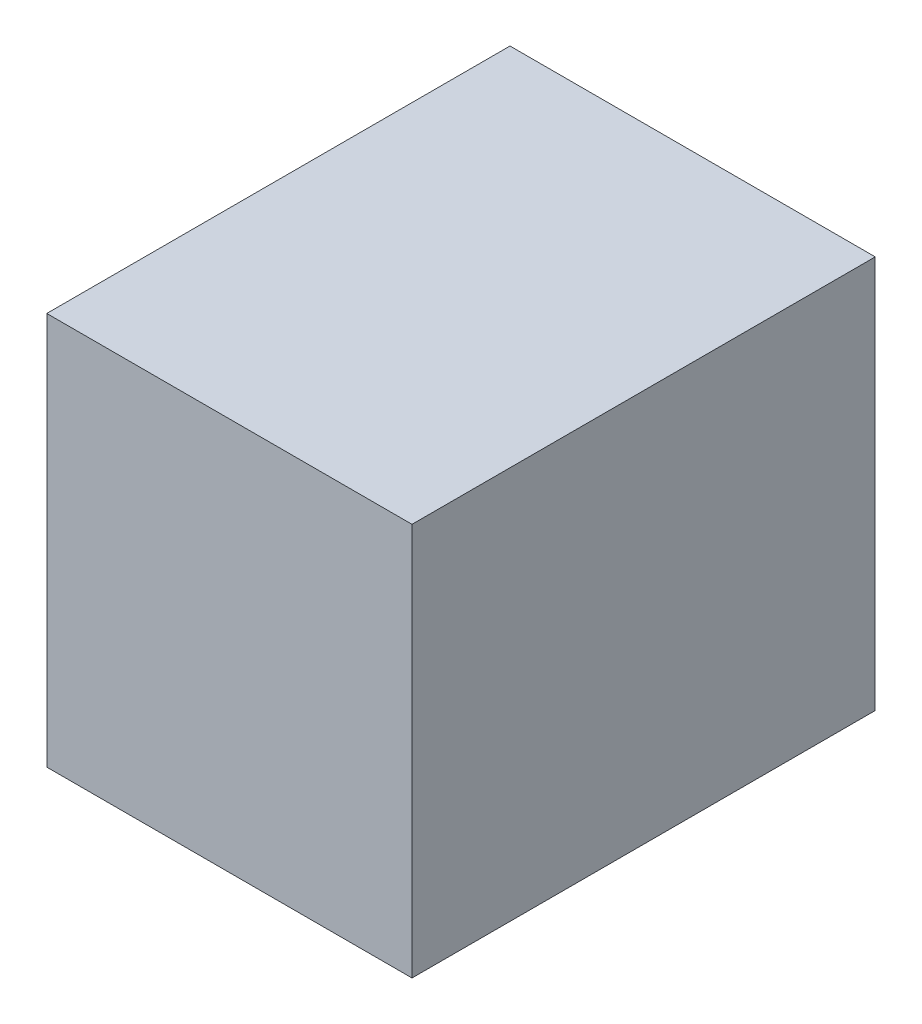
ISO-10303-21;
HEADER;
FILE_DESCRIPTION(('STEP AP214'),'2;1');
FILE_NAME('part.step','',(''),(''),'','','');
FILE_SCHEMA(('AUTOMOTIVE_DESIGN { 1 0 10303 214 1 1 1 1 }'));
ENDSEC;
DATA;
#1=APPLICATION_CONTEXT('core data for automotive mechanical design processes');
#2=APPLICATION_PROTOCOL_DEFINITION('international standard','automotive_design',2000,#1);
#3=PRODUCT_CONTEXT('',#1,'mechanical');
#4=PRODUCT('Part','Part','',(#3));
#5=PRODUCT_RELATED_PRODUCT_CATEGORY('part','',(#4));
#6=PRODUCT_DEFINITION_FORMATION('','',#4);
#7=PRODUCT_DEFINITION_CONTEXT('part definition',#1,'design');
#8=PRODUCT_DEFINITION('design','',#6,#7);
#9=PRODUCT_DEFINITION_SHAPE('','',#8);
#10=(LENGTH_UNIT() NAMED_UNIT(*) SI_UNIT(.MILLI.,.METRE.));
#11=(NAMED_UNIT(*) PLANE_ANGLE_UNIT() SI_UNIT($,.RADIAN.));
#12=(NAMED_UNIT(*) SI_UNIT($,.STERADIAN.) SOLID_ANGLE_UNIT());
#13=UNCERTAINTY_MEASURE_WITH_UNIT(LENGTH_MEASURE(1.E-05),#10,'distance_accuracy_value','');
#14=(GEOMETRIC_REPRESENTATION_CONTEXT(3) GLOBAL_UNCERTAINTY_ASSIGNED_CONTEXT((#13)) GLOBAL_UNIT_ASSIGNED_CONTEXT((#10,
#11,#12)) REPRESENTATION_CONTEXT('',''));
#15=CARTESIAN_POINT('',(0.,0.,0.));
#16=DIRECTION('',(0.,0.,1.));
#17=DIRECTION('',(1.,0.,0.));
#18=AXIS2_PLACEMENT_3D('',#15,#16,#17);
#19=CARTESIAN_POINT('',(-300.,0.,-500.));
#20=DIRECTION('',(1.,0.,0.));
#21=DIRECTION('',(0.,1.,0.));
#22=AXIS2_PLACEMENT_3D('',#19,#20,#21);
#23=PLANE('',#22);
#24=DIRECTION('',(0.,1.,0.));
#25=VECTOR('',#24,1.);
#26=CARTESIAN_POINT('',(-300.,0.,10.));
#27=LINE('',#26,#25);
#28=CARTESIAN_POINT('',(-300.,-120.526315789474,10.));
#29=VERTEX_POINT('',#28);
#30=CARTESIAN_POINT('',(-300.,320.526315789474,10.));
#31=VERTEX_POINT('',#30);
#32=EDGE_CURVE('E157',#29,#31,#27,.T.);
#33=ORIENTED_EDGE('',*,*,#32,.T.);
#34=DIRECTION('',(0.,0.,1.));
#35=VECTOR('',#34,1.);
#36=CARTESIAN_POINT('',(-300.,320.526315789474,-500.));
#37=LINE('',#36,#35);
#38=CARTESIAN_POINT('',(-300.,320.526315789474,-510.));
#39=VERTEX_POINT('',#38);
#40=EDGE_CURVE('E155',#39,#31,#37,.T.);
#41=ORIENTED_EDGE('',*,*,#40,.F.);
#42=DIRECTION('',(0.,1.,0.));
#43=VECTOR('',#42,1.);
#44=CARTESIAN_POINT('',(-300.,0.,-510.));
#45=LINE('',#44,#43);
#46=CARTESIAN_POINT('',(-300.,-120.526315789474,-510.));
#47=VERTEX_POINT('',#46);
#48=EDGE_CURVE('E36',#47,#39,#45,.T.);
#49=ORIENTED_EDGE('',*,*,#48,.F.);
#50=DIRECTION('',(0.,0.,1.));
#51=VECTOR('',#50,1.);
#52=CARTESIAN_POINT('',(-300.,-120.526315789474,-500.));
#53=LINE('',#52,#51);
#54=EDGE_CURVE('E41',#47,#29,#53,.T.);
#55=ORIENTED_EDGE('',*,*,#54,.T.);
#56=EDGE_LOOP('',(#33,#41,#49,#55));
#57=FACE_BOUND('',#56,.T.);
#58=DIRECTION('',(0.,1.,0.));
#59=VECTOR('',#58,1.);
#60=CARTESIAN_POINT('',(-300.,0.,0.));
#61=LINE('',#60,#59);
#62=CARTESIAN_POINT('',(-300.,-110.526315789474,0.));
#63=VERTEX_POINT('',#62);
#64=CARTESIAN_POINT('',(-300.,310.526315789474,0.));
#65=VERTEX_POINT('',#64);
#66=EDGE_CURVE('E137',#63,#65,#61,.T.);
#67=ORIENTED_EDGE('',*,*,#66,.F.);
#68=DIRECTION('',(0.,0.,1.));
#69=VECTOR('',#68,1.);
#70=CARTESIAN_POINT('',(-300.,-110.526315789474,-500.));
#71=LINE('',#70,#69);
#72=CARTESIAN_POINT('',(-300.,-110.526315789474,-500.));
#73=VERTEX_POINT('',#72);
#74=EDGE_CURVE('E143',#73,#63,#71,.T.);
#75=ORIENTED_EDGE('',*,*,#74,.F.);
#76=DIRECTION('',(0.,1.,0.));
#77=VECTOR('',#76,1.);
#78=CARTESIAN_POINT('',(-300.,0.,-500.));
#79=LINE('',#78,#77);
#80=CARTESIAN_POINT('',(-300.,310.526315789474,-500.));
#81=VERTEX_POINT('',#80);
#82=EDGE_CURVE('E49',#73,#81,#79,.T.);
#83=ORIENTED_EDGE('',*,*,#82,.T.);
#84=DIRECTION('',(0.,0.,1.));
#85=VECTOR('',#84,1.);
#86=CARTESIAN_POINT('',(-300.,310.526315789474,-500.));
#87=LINE('',#86,#85);
#88=EDGE_CURVE('E121',#81,#65,#87,.T.);
#89=ORIENTED_EDGE('',*,*,#88,.T.);
#90=EDGE_LOOP('',(#67,#75,#83,#89));
#91=FACE_BOUND('',#90,.T.);
#92=ADVANCED_FACE('F32',(#57,#91),#23,.F.);
#93=CARTESIAN_POINT('',(110.,0.,-500.));
#94=DIRECTION('',(-1.,0.,0.));
#95=DIRECTION('',(0.,-1.,0.));
#96=AXIS2_PLACEMENT_3D('',#93,#94,#95);
#97=PLANE('',#96);
#98=DIRECTION('',(0.,-1.,0.));
#99=VECTOR('',#98,1.);
#100=CARTESIAN_POINT('',(110.,0.,10.));
#101=LINE('',#100,#99);
#102=CARTESIAN_POINT('',(110.,320.526315789474,10.));
#103=VERTEX_POINT('',#102);
#104=CARTESIAN_POINT('',(110.,-120.526315789474,10.));
#105=VERTEX_POINT('',#104);
#106=EDGE_CURVE('E142',#103,#105,#101,.T.);
#107=ORIENTED_EDGE('',*,*,#106,.T.);
#108=DIRECTION('',(0.,0.,1.));
#109=VECTOR('',#108,1.);
#110=CARTESIAN_POINT('',(110.,-120.526315789474,-500.));
#111=LINE('',#110,#109);
#112=CARTESIAN_POINT('',(110.,-120.526315789474,-510.));
#113=VERTEX_POINT('',#112);
#114=EDGE_CURVE('E11',#113,#105,#111,.T.);
#115=ORIENTED_EDGE('',*,*,#114,.F.);
#116=DIRECTION('',(0.,-1.,0.));
#117=VECTOR('',#116,1.);
#118=CARTESIAN_POINT('',(110.,0.,-510.));
#119=LINE('',#118,#117);
#120=CARTESIAN_POINT('',(110.,320.526315789474,-510.));
#121=VERTEX_POINT('',#120);
#122=EDGE_CURVE('E150',#121,#113,#119,.T.);
#123=ORIENTED_EDGE('',*,*,#122,.F.);
#124=DIRECTION('',(0.,0.,1.));
#125=VECTOR('',#124,1.);
#126=CARTESIAN_POINT('',(110.,320.526315789474,-500.));
#127=LINE('',#126,#125);
#128=EDGE_CURVE('E82',#121,#103,#127,.T.);
#129=ORIENTED_EDGE('',*,*,#128,.T.);
#130=EDGE_LOOP('',(#107,#115,#123,#129));
#131=FACE_BOUND('',#130,.T.);
#132=ADVANCED_FACE('F173',(#131),#97,.F.);
#133=CARTESIAN_POINT('',(0.,-120.526315789474,-500.));
#134=DIRECTION('',(0.,1.,0.));
#135=DIRECTION('',(-1.,0.,0.));
#136=AXIS2_PLACEMENT_3D('',#133,#134,#135);
#137=PLANE('',#136);
#138=DIRECTION('',(-1.,0.,0.));
#139=VECTOR('',#138,1.);
#140=CARTESIAN_POINT('',(0.,-120.526315789474,10.));
#141=LINE('',#140,#139);
#142=EDGE_CURVE('E153',#105,#29,#141,.T.);
#143=ORIENTED_EDGE('',*,*,#142,.T.);
#144=ORIENTED_EDGE('',*,*,#54,.F.);
#145=DIRECTION('',(-1.,0.,0.));
#146=VECTOR('',#145,1.);
#147=CARTESIAN_POINT('',(0.,-120.526315789474,-510.));
#148=LINE('',#147,#146);
#149=EDGE_CURVE('E57',#113,#47,#148,.T.);
#150=ORIENTED_EDGE('',*,*,#149,.F.);
#151=ORIENTED_EDGE('',*,*,#114,.T.);
#152=EDGE_LOOP('',(#143,#144,#150,#151));
#153=FACE_BOUND('',#152,.T.);
#154=ADVANCED_FACE('F180',(#153),#137,.F.);
#155=CARTESIAN_POINT('',(0.,320.526315789474,-500.));
#156=DIRECTION('',(0.,1.,0.));
#157=DIRECTION('',(0.,0.,1.));
#158=AXIS2_PLACEMENT_3D('',#155,#156,#157);
#159=PLANE('',#158);
#160=DIRECTION('',(-1.,0.,0.));
#161=VECTOR('',#160,1.);
#162=CARTESIAN_POINT('',(0.,320.526315789474,10.));
#163=LINE('',#162,#161);
#164=EDGE_CURVE('E148',#103,#31,#163,.T.);
#165=ORIENTED_EDGE('',*,*,#164,.F.);
#166=ORIENTED_EDGE('',*,*,#128,.F.);
#167=DIRECTION('',(-1.,0.,0.));
#168=VECTOR('',#167,1.);
#169=CARTESIAN_POINT('',(0.,320.526315789474,-510.));
#170=LINE('',#169,#168);
#171=EDGE_CURVE('E152',#121,#39,#170,.T.);
#172=ORIENTED_EDGE('',*,*,#171,.T.);
#173=ORIENTED_EDGE('',*,*,#40,.T.);
#174=EDGE_LOOP('',(#165,#166,#172,#173));
#175=FACE_BOUND('',#174,.T.);
#176=ADVANCED_FACE('F165',(#175),#159,.T.);
#177=CARTESIAN_POINT('',(0.,0.,-510.));
#178=DIRECTION('',(0.,0.,1.));
#179=DIRECTION('',(1.,0.,0.));
#180=AXIS2_PLACEMENT_3D('',#177,#178,#179);
#181=PLANE('',#180);
#182=ORIENTED_EDGE('',*,*,#122,.T.);
#183=ORIENTED_EDGE('',*,*,#149,.T.);
#184=ORIENTED_EDGE('',*,*,#48,.T.);
#185=ORIENTED_EDGE('',*,*,#171,.F.);
#186=EDGE_LOOP('',(#182,#183,#184,#185));
#187=FACE_BOUND('',#186,.T.);
#188=ADVANCED_FACE('F174',(#187),#181,.F.);
#189=CARTESIAN_POINT('',(0.,0.,10.));
#190=DIRECTION('',(0.,0.,1.));
#191=DIRECTION('',(1.,0.,0.));
#192=AXIS2_PLACEMENT_3D('',#189,#190,#191);
#193=PLANE('',#192);
#194=ORIENTED_EDGE('',*,*,#106,.F.);
#195=ORIENTED_EDGE('',*,*,#164,.T.);
#196=ORIENTED_EDGE('',*,*,#32,.F.);
#197=ORIENTED_EDGE('',*,*,#142,.F.);
#198=EDGE_LOOP('',(#194,#195,#196,#197));
#199=FACE_BOUND('',#198,.T.);
#200=ADVANCED_FACE('F34',(#199),#193,.T.);
#201=CARTESIAN_POINT('',(100.,0.,-500.));
#202=DIRECTION('',(-1.,0.,0.));
#203=DIRECTION('',(0.,-1.,0.));
#204=AXIS2_PLACEMENT_3D('',#201,#202,#203);
#205=PLANE('',#204);
#206=DIRECTION('',(0.,-1.,0.));
#207=VECTOR('',#206,1.);
#208=CARTESIAN_POINT('',(100.,0.,0.));
#209=LINE('',#208,#207);
#210=CARTESIAN_POINT('',(100.,310.526315789474,0.));
#211=VERTEX_POINT('',#210);
#212=CARTESIAN_POINT('',(100.,-110.526315789474,0.));
#213=VERTEX_POINT('',#212);
#214=EDGE_CURVE('E116',#211,#213,#209,.T.);
#215=ORIENTED_EDGE('',*,*,#214,.F.);
#216=DIRECTION('',(0.,0.,1.));
#217=VECTOR('',#216,1.);
#218=CARTESIAN_POINT('',(100.,310.526315789474,-500.));
#219=LINE('',#218,#217);
#220=CARTESIAN_POINT('',(100.,310.526315789474,-500.));
#221=VERTEX_POINT('',#220);
#222=EDGE_CURVE('E109',#221,#211,#219,.T.);
#223=ORIENTED_EDGE('',*,*,#222,.F.);
#224=DIRECTION('',(0.,-1.,0.));
#225=VECTOR('',#224,1.);
#226=CARTESIAN_POINT('',(100.,0.,-500.));
#227=LINE('',#226,#225);
#228=CARTESIAN_POINT('',(100.,-110.526315789474,-500.));
#229=VERTEX_POINT('',#228);
#230=EDGE_CURVE('E113',#221,#229,#227,.T.);
#231=ORIENTED_EDGE('',*,*,#230,.T.);
#232=DIRECTION('',(0.,0.,1.));
#233=VECTOR('',#232,1.);
#234=CARTESIAN_POINT('',(100.,-110.526315789474,-500.));
#235=LINE('',#234,#233);
#236=EDGE_CURVE('E140',#229,#213,#235,.T.);
#237=ORIENTED_EDGE('',*,*,#236,.T.);
#238=EDGE_LOOP('',(#215,#223,#231,#237));
#239=FACE_BOUND('',#238,.T.);
#240=ADVANCED_FACE('F111',(#239),#205,.T.);
#241=CARTESIAN_POINT('',(0.,-110.526315789474,-500.));
#242=DIRECTION('',(0.,1.,0.));
#243=DIRECTION('',(-1.,0.,0.));
#244=AXIS2_PLACEMENT_3D('',#241,#242,#243);
#245=PLANE('',#244);
#246=DIRECTION('',(-1.,0.,0.));
#247=VECTOR('',#246,1.);
#248=CARTESIAN_POINT('',(0.,-110.526315789474,0.));
#249=LINE('',#248,#247);
#250=EDGE_CURVE('E126',#213,#63,#249,.T.);
#251=ORIENTED_EDGE('',*,*,#250,.F.);
#252=ORIENTED_EDGE('',*,*,#236,.F.);
#253=DIRECTION('',(-1.,0.,0.));
#254=VECTOR('',#253,1.);
#255=CARTESIAN_POINT('',(0.,-110.526315789474,-500.));
#256=LINE('',#255,#254);
#257=EDGE_CURVE('E122',#229,#73,#256,.T.);
#258=ORIENTED_EDGE('',*,*,#257,.T.);
#259=ORIENTED_EDGE('',*,*,#74,.T.);
#260=EDGE_LOOP('',(#251,#252,#258,#259));
#261=FACE_BOUND('',#260,.T.);
#262=ADVANCED_FACE('F219',(#261),#245,.T.);
#263=CARTESIAN_POINT('',(0.,310.526315789474,-500.));
#264=DIRECTION('',(0.,1.,0.));
#265=DIRECTION('',(0.,0.,1.));
#266=AXIS2_PLACEMENT_3D('',#263,#264,#265);
#267=PLANE('',#266);
#268=DIRECTION('',(-1.,0.,0.));
#269=VECTOR('',#268,1.);
#270=CARTESIAN_POINT('',(0.,310.526315789474,0.));
#271=LINE('',#270,#269);
#272=EDGE_CURVE('E135',#211,#65,#271,.T.);
#273=ORIENTED_EDGE('',*,*,#272,.T.);
#274=ORIENTED_EDGE('',*,*,#88,.F.);
#275=DIRECTION('',(-1.,0.,0.));
#276=VECTOR('',#275,1.);
#277=CARTESIAN_POINT('',(0.,310.526315789474,-500.));
#278=LINE('',#277,#276);
#279=EDGE_CURVE('E125',#221,#81,#278,.T.);
#280=ORIENTED_EDGE('',*,*,#279,.F.);
#281=ORIENTED_EDGE('',*,*,#222,.T.);
#282=EDGE_LOOP('',(#273,#274,#280,#281));
#283=FACE_BOUND('',#282,.T.);
#284=ADVANCED_FACE('F128',(#283),#267,.F.);
#285=CARTESIAN_POINT('',(0.,0.,-500.));
#286=DIRECTION('',(0.,0.,1.));
#287=DIRECTION('',(1.,0.,0.));
#288=AXIS2_PLACEMENT_3D('',#285,#286,#287);
#289=PLANE('',#288);
#290=ORIENTED_EDGE('',*,*,#230,.F.);
#291=ORIENTED_EDGE('',*,*,#279,.T.);
#292=ORIENTED_EDGE('',*,*,#82,.F.);
#293=ORIENTED_EDGE('',*,*,#257,.F.);
#294=EDGE_LOOP('',(#290,#291,#292,#293));
#295=FACE_BOUND('',#294,.T.);
#296=ADVANCED_FACE('F124',(#295),#289,.T.);
#297=CARTESIAN_POINT('',(0.,0.,0.));
#298=DIRECTION('',(0.,0.,1.));
#299=DIRECTION('',(1.,0.,0.));
#300=AXIS2_PLACEMENT_3D('',#297,#298,#299);
#301=PLANE('',#300);
#302=ORIENTED_EDGE('',*,*,#214,.T.);
#303=ORIENTED_EDGE('',*,*,#250,.T.);
#304=ORIENTED_EDGE('',*,*,#66,.T.);
#305=ORIENTED_EDGE('',*,*,#272,.F.);
#306=EDGE_LOOP('',(#302,#303,#304,#305));
#307=FACE_BOUND('',#306,.T.);
#308=ADVANCED_FACE('F244',(#307),#301,.F.);
#309=CLOSED_SHELL('',(#92,#132,#154,#176,#188,#200,#240,#262,#284,#296,#308));
#310=MANIFOLD_SOLID_BREP('B2',#309);
#311=ADVANCED_BREP_SHAPE_REPRESENTATION('',(#18,#310),#14);
#312=SHAPE_DEFINITION_REPRESENTATION(#9,#311);
ENDSEC;
END-ISO-10303-21;
